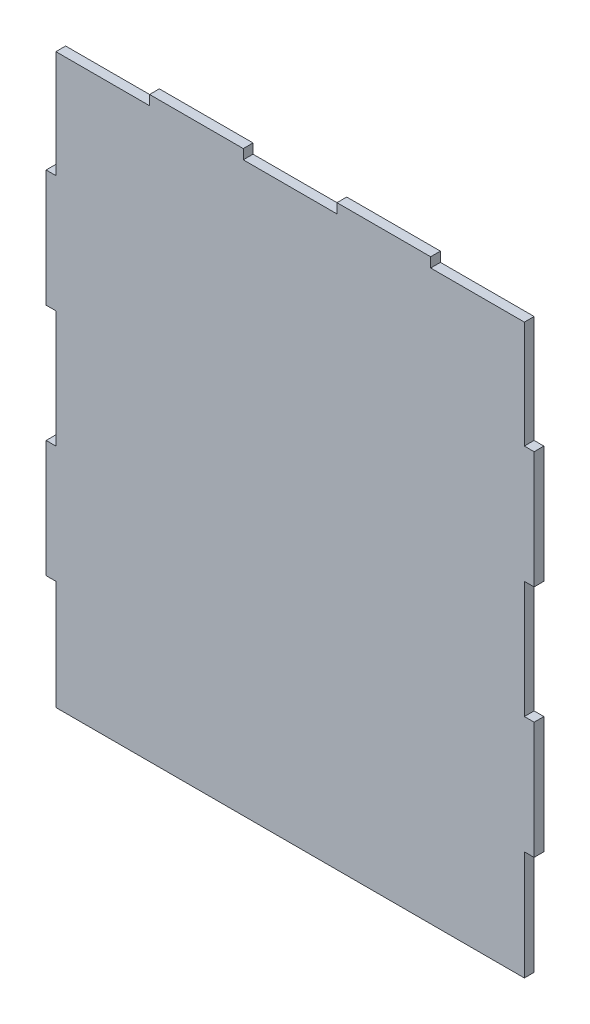
ISO-10303-21;
HEADER;
FILE_DESCRIPTION(('STEP AP214'),'2;1');
FILE_NAME('part.step','',(''),(''),'','','');
FILE_SCHEMA(('AUTOMOTIVE_DESIGN { 1 0 10303 214 1 1 1 1 }'));
ENDSEC;
DATA;
#1=APPLICATION_CONTEXT('core data for automotive mechanical design processes');
#2=APPLICATION_PROTOCOL_DEFINITION('international standard','automotive_design',2000,#1);
#3=PRODUCT_CONTEXT('',#1,'mechanical');
#4=PRODUCT('Part','Part','',(#3));
#5=PRODUCT_RELATED_PRODUCT_CATEGORY('part','',(#4));
#6=PRODUCT_DEFINITION_FORMATION('','',#4);
#7=PRODUCT_DEFINITION_CONTEXT('part definition',#1,'design');
#8=PRODUCT_DEFINITION('design','',#6,#7);
#9=PRODUCT_DEFINITION_SHAPE('','',#8);
#10=(LENGTH_UNIT() NAMED_UNIT(*) SI_UNIT(.MILLI.,.METRE.));
#11=(NAMED_UNIT(*) PLANE_ANGLE_UNIT() SI_UNIT($,.RADIAN.));
#12=(NAMED_UNIT(*) SI_UNIT($,.STERADIAN.) SOLID_ANGLE_UNIT());
#13=UNCERTAINTY_MEASURE_WITH_UNIT(LENGTH_MEASURE(1.E-05),#10,'distance_accuracy_value','');
#14=(GEOMETRIC_REPRESENTATION_CONTEXT(3) GLOBAL_UNCERTAINTY_ASSIGNED_CONTEXT((#13)) GLOBAL_UNIT_ASSIGNED_CONTEXT((#10,
#11,#12)) REPRESENTATION_CONTEXT('',''));
#15=CARTESIAN_POINT('',(0.,0.,0.));
#16=DIRECTION('',(0.,0.,1.));
#17=DIRECTION('',(1.,0.,0.));
#18=AXIS2_PLACEMENT_3D('',#15,#16,#17);
#19=CARTESIAN_POINT('',(245.,236.,5.));
#20=DIRECTION('',(0.,-1.,0.));
#21=DIRECTION('',(1.,0.,0.));
#22=AXIS2_PLACEMENT_3D('',#19,#20,#21);
#23=PLANE('',#22);
#24=DIRECTION('',(-1.,0.,0.));
#25=VECTOR('',#24,1.);
#26=CARTESIAN_POINT('',(245.,236.,0.));
#27=LINE('',#26,#25);
#28=CARTESIAN_POINT('',(250.,236.,0.));
#29=VERTEX_POINT('',#28);
#30=CARTESIAN_POINT('',(245.,236.,0.));
#31=VERTEX_POINT('',#30);
#32=EDGE_CURVE('E252',#29,#31,#27,.T.);
#33=ORIENTED_EDGE('',*,*,#32,.T.);
#34=DIRECTION('',(0.,0.,-1.));
#35=VECTOR('',#34,1.);
#36=CARTESIAN_POINT('',(245.,236.,5.));
#37=LINE('',#36,#35);
#38=CARTESIAN_POINT('',(245.,236.,5.));
#39=VERTEX_POINT('',#38);
#40=EDGE_CURVE('E11',#39,#31,#37,.T.);
#41=ORIENTED_EDGE('',*,*,#40,.F.);
#42=DIRECTION('',(-1.,0.,0.));
#43=VECTOR('',#42,1.);
#44=CARTESIAN_POINT('',(245.,236.,5.));
#45=LINE('',#44,#43);
#46=CARTESIAN_POINT('',(250.,236.,5.));
#47=VERTEX_POINT('',#46);
#48=EDGE_CURVE('E306',#47,#39,#45,.T.);
#49=ORIENTED_EDGE('',*,*,#48,.F.);
#50=DIRECTION('',(0.,0.,-1.));
#51=VECTOR('',#50,1.);
#52=CARTESIAN_POINT('',(250.,236.,5.));
#53=LINE('',#52,#51);
#54=EDGE_CURVE('E248',#47,#29,#53,.T.);
#55=ORIENTED_EDGE('',*,*,#54,.T.);
#56=EDGE_LOOP('',(#33,#41,#49,#55));
#57=FACE_BOUND('',#56,.T.);
#58=ADVANCED_FACE('F36',(#57),#23,.F.);
#59=CARTESIAN_POINT('',(245.,291.,5.));
#60=DIRECTION('',(-1.,0.,0.));
#61=DIRECTION('',(0.,0.,1.));
#62=AXIS2_PLACEMENT_3D('',#59,#60,#61);
#63=PLANE('',#62);
#64=DIRECTION('',(0.,1.,0.));
#65=VECTOR('',#64,1.);
#66=CARTESIAN_POINT('',(245.,291.,0.));
#67=LINE('',#66,#65);
#68=CARTESIAN_POINT('',(245.,291.,0.));
#69=VERTEX_POINT('',#68);
#70=EDGE_CURVE('E255',#31,#69,#67,.T.);
#71=ORIENTED_EDGE('',*,*,#70,.T.);
#72=DIRECTION('',(0.,0.,-1.));
#73=VECTOR('',#72,1.);
#74=CARTESIAN_POINT('',(245.,291.,5.));
#75=LINE('',#74,#73);
#76=CARTESIAN_POINT('',(245.,291.,5.));
#77=VERTEX_POINT('',#76);
#78=EDGE_CURVE('E44',#77,#69,#75,.T.);
#79=ORIENTED_EDGE('',*,*,#78,.F.);
#80=DIRECTION('',(0.,1.,0.));
#81=VECTOR('',#80,1.);
#82=CARTESIAN_POINT('',(245.,291.,5.));
#83=LINE('',#82,#81);
#84=EDGE_CURVE('E155',#39,#77,#83,.T.);
#85=ORIENTED_EDGE('',*,*,#84,.F.);
#86=ORIENTED_EDGE('',*,*,#40,.T.);
#87=EDGE_LOOP('',(#71,#79,#85,#86));
#88=FACE_BOUND('',#87,.T.);
#89=ADVANCED_FACE('F464',(#88),#63,.F.);
#90=CARTESIAN_POINT('',(197.,291.,5.));
#91=DIRECTION('',(0.,-1.,0.));
#92=DIRECTION('',(0.,0.,-1.));
#93=AXIS2_PLACEMENT_3D('',#90,#91,#92);
#94=PLANE('',#93);
#95=DIRECTION('',(-1.,0.,0.));
#96=VECTOR('',#95,1.);
#97=CARTESIAN_POINT('',(197.,291.,0.));
#98=LINE('',#97,#96);
#99=CARTESIAN_POINT('',(197.,291.,0.));
#100=VERTEX_POINT('',#99);
#101=EDGE_CURVE('E257',#69,#100,#98,.T.);
#102=ORIENTED_EDGE('',*,*,#101,.T.);
#103=DIRECTION('',(0.,0.,-1.));
#104=VECTOR('',#103,1.);
#105=CARTESIAN_POINT('',(197.,291.,5.));
#106=LINE('',#105,#104);
#107=CARTESIAN_POINT('',(197.,291.,5.));
#108=VERTEX_POINT('',#107);
#109=EDGE_CURVE('E373',#108,#100,#106,.T.);
#110=ORIENTED_EDGE('',*,*,#109,.F.);
#111=DIRECTION('',(-1.,0.,0.));
#112=VECTOR('',#111,1.);
#113=CARTESIAN_POINT('',(197.,291.,5.));
#114=LINE('',#113,#112);
#115=EDGE_CURVE('E381',#77,#108,#114,.T.);
#116=ORIENTED_EDGE('',*,*,#115,.F.);
#117=ORIENTED_EDGE('',*,*,#78,.T.);
#118=EDGE_LOOP('',(#102,#110,#116,#117));
#119=FACE_BOUND('',#118,.T.);
#120=ADVANCED_FACE('F379',(#119),#94,.F.);
#121=CARTESIAN_POINT('',(197.,296.,5.));
#122=DIRECTION('',(-1.,0.,0.));
#123=DIRECTION('',(0.,-1.,0.));
#124=AXIS2_PLACEMENT_3D('',#121,#122,#123);
#125=PLANE('',#124);
#126=DIRECTION('',(0.,1.,0.));
#127=VECTOR('',#126,1.);
#128=CARTESIAN_POINT('',(197.,296.,0.));
#129=LINE('',#128,#127);
#130=CARTESIAN_POINT('',(197.,296.,0.));
#131=VERTEX_POINT('',#130);
#132=EDGE_CURVE('E259',#100,#131,#129,.T.);
#133=ORIENTED_EDGE('',*,*,#132,.T.);
#134=DIRECTION('',(0.,0.,-1.));
#135=VECTOR('',#134,1.);
#136=CARTESIAN_POINT('',(197.,296.,5.));
#137=LINE('',#136,#135);
#138=CARTESIAN_POINT('',(197.,296.,5.));
#139=VERTEX_POINT('',#138);
#140=EDGE_CURVE('E370',#139,#131,#137,.T.);
#141=ORIENTED_EDGE('',*,*,#140,.F.);
#142=DIRECTION('',(0.,1.,0.));
#143=VECTOR('',#142,1.);
#144=CARTESIAN_POINT('',(197.,296.,5.));
#145=LINE('',#144,#143);
#146=EDGE_CURVE('E399',#108,#139,#145,.T.);
#147=ORIENTED_EDGE('',*,*,#146,.F.);
#148=ORIENTED_EDGE('',*,*,#109,.T.);
#149=EDGE_LOOP('',(#133,#141,#147,#148));
#150=FACE_BOUND('',#149,.T.);
#151=ADVANCED_FACE('F390',(#150),#125,.F.);
#152=CARTESIAN_POINT('',(149.,296.,5.));
#153=DIRECTION('',(0.,-1.,0.));
#154=DIRECTION('',(0.,0.,-1.));
#155=AXIS2_PLACEMENT_3D('',#152,#153,#154);
#156=PLANE('',#155);
#157=DIRECTION('',(-1.,0.,0.));
#158=VECTOR('',#157,1.);
#159=CARTESIAN_POINT('',(149.,296.,0.));
#160=LINE('',#159,#158);
#161=CARTESIAN_POINT('',(149.,296.,0.));
#162=VERTEX_POINT('',#161);
#163=EDGE_CURVE('E261',#131,#162,#160,.T.);
#164=ORIENTED_EDGE('',*,*,#163,.T.);
#165=DIRECTION('',(0.,0.,-1.));
#166=VECTOR('',#165,1.);
#167=CARTESIAN_POINT('',(149.,296.,5.));
#168=LINE('',#167,#166);
#169=CARTESIAN_POINT('',(149.,296.,5.));
#170=VERTEX_POINT('',#169);
#171=EDGE_CURVE('E367',#170,#162,#168,.T.);
#172=ORIENTED_EDGE('',*,*,#171,.F.);
#173=DIRECTION('',(-1.,0.,0.));
#174=VECTOR('',#173,1.);
#175=CARTESIAN_POINT('',(149.,296.,5.));
#176=LINE('',#175,#174);
#177=EDGE_CURVE('E396',#139,#170,#176,.T.);
#178=ORIENTED_EDGE('',*,*,#177,.F.);
#179=ORIENTED_EDGE('',*,*,#140,.T.);
#180=EDGE_LOOP('',(#164,#172,#178,#179));
#181=FACE_BOUND('',#180,.T.);
#182=ADVANCED_FACE('F394',(#181),#156,.F.);
#183=CARTESIAN_POINT('',(149.,291.,5.));
#184=DIRECTION('',(1.,0.,0.));
#185=DIRECTION('',(0.,0.,-1.));
#186=AXIS2_PLACEMENT_3D('',#183,#184,#185);
#187=PLANE('',#186);
#188=DIRECTION('',(0.,-1.,0.));
#189=VECTOR('',#188,1.);
#190=CARTESIAN_POINT('',(149.,291.,0.));
#191=LINE('',#190,#189);
#192=CARTESIAN_POINT('',(149.,291.,0.));
#193=VERTEX_POINT('',#192);
#194=EDGE_CURVE('E263',#162,#193,#191,.T.);
#195=ORIENTED_EDGE('',*,*,#194,.T.);
#196=DIRECTION('',(0.,0.,-1.));
#197=VECTOR('',#196,1.);
#198=CARTESIAN_POINT('',(149.,291.,5.));
#199=LINE('',#198,#197);
#200=CARTESIAN_POINT('',(149.,291.,5.));
#201=VERTEX_POINT('',#200);
#202=EDGE_CURVE('E364',#201,#193,#199,.T.);
#203=ORIENTED_EDGE('',*,*,#202,.F.);
#204=DIRECTION('',(0.,-1.,0.));
#205=VECTOR('',#204,1.);
#206=CARTESIAN_POINT('',(149.,291.,5.));
#207=LINE('',#206,#205);
#208=EDGE_CURVE('E398',#170,#201,#207,.T.);
#209=ORIENTED_EDGE('',*,*,#208,.F.);
#210=ORIENTED_EDGE('',*,*,#171,.T.);
#211=EDGE_LOOP('',(#195,#203,#209,#210));
#212=FACE_BOUND('',#211,.T.);
#213=ADVANCED_FACE('F477',(#212),#187,.F.);
#214=CARTESIAN_POINT('',(101.,291.,5.));
#215=DIRECTION('',(0.,-1.,0.));
#216=DIRECTION('',(0.,0.,-1.));
#217=AXIS2_PLACEMENT_3D('',#214,#215,#216);
#218=PLANE('',#217);
#219=DIRECTION('',(-1.,0.,0.));
#220=VECTOR('',#219,1.);
#221=CARTESIAN_POINT('',(101.,291.,0.));
#222=LINE('',#221,#220);
#223=CARTESIAN_POINT('',(101.,291.,0.));
#224=VERTEX_POINT('',#223);
#225=EDGE_CURVE('E265',#193,#224,#222,.T.);
#226=ORIENTED_EDGE('',*,*,#225,.T.);
#227=DIRECTION('',(0.,0.,-1.));
#228=VECTOR('',#227,1.);
#229=CARTESIAN_POINT('',(101.,291.,5.));
#230=LINE('',#229,#228);
#231=CARTESIAN_POINT('',(101.,291.,5.));
#232=VERTEX_POINT('',#231);
#233=EDGE_CURVE('E361',#232,#224,#230,.T.);
#234=ORIENTED_EDGE('',*,*,#233,.F.);
#235=DIRECTION('',(-1.,0.,0.));
#236=VECTOR('',#235,1.);
#237=CARTESIAN_POINT('',(101.,291.,5.));
#238=LINE('',#237,#236);
#239=EDGE_CURVE('E401',#201,#232,#238,.T.);
#240=ORIENTED_EDGE('',*,*,#239,.F.);
#241=ORIENTED_EDGE('',*,*,#202,.T.);
#242=EDGE_LOOP('',(#226,#234,#240,#241));
#243=FACE_BOUND('',#242,.T.);
#244=ADVANCED_FACE('F480',(#243),#218,.F.);
#245=CARTESIAN_POINT('',(101.,296.,5.));
#246=DIRECTION('',(-1.,0.,0.));
#247=DIRECTION('',(0.,-1.,0.));
#248=AXIS2_PLACEMENT_3D('',#245,#246,#247);
#249=PLANE('',#248);
#250=DIRECTION('',(0.,1.,0.));
#251=VECTOR('',#250,1.);
#252=CARTESIAN_POINT('',(101.,296.,0.));
#253=LINE('',#252,#251);
#254=CARTESIAN_POINT('',(101.,296.,0.));
#255=VERTEX_POINT('',#254);
#256=EDGE_CURVE('E267',#224,#255,#253,.T.);
#257=ORIENTED_EDGE('',*,*,#256,.T.);
#258=DIRECTION('',(0.,0.,-1.));
#259=VECTOR('',#258,1.);
#260=CARTESIAN_POINT('',(101.,296.,5.));
#261=LINE('',#260,#259);
#262=CARTESIAN_POINT('',(101.,296.,5.));
#263=VERTEX_POINT('',#262);
#264=EDGE_CURVE('E358',#263,#255,#261,.T.);
#265=ORIENTED_EDGE('',*,*,#264,.F.);
#266=DIRECTION('',(0.,1.,0.));
#267=VECTOR('',#266,1.);
#268=CARTESIAN_POINT('',(101.,296.,5.));
#269=LINE('',#268,#267);
#270=EDGE_CURVE('E407',#232,#263,#269,.T.);
#271=ORIENTED_EDGE('',*,*,#270,.F.);
#272=ORIENTED_EDGE('',*,*,#233,.T.);
#273=EDGE_LOOP('',(#257,#265,#271,#272));
#274=FACE_BOUND('',#273,.T.);
#275=ADVANCED_FACE('F484',(#274),#249,.F.);
#276=CARTESIAN_POINT('',(53.,296.,5.));
#277=DIRECTION('',(0.,-1.,0.));
#278=DIRECTION('',(0.,0.,-1.));
#279=AXIS2_PLACEMENT_3D('',#276,#277,#278);
#280=PLANE('',#279);
#281=DIRECTION('',(-1.,0.,0.));
#282=VECTOR('',#281,1.);
#283=CARTESIAN_POINT('',(53.,296.,0.));
#284=LINE('',#283,#282);
#285=CARTESIAN_POINT('',(53.,296.,0.));
#286=VERTEX_POINT('',#285);
#287=EDGE_CURVE('E269',#255,#286,#284,.T.);
#288=ORIENTED_EDGE('',*,*,#287,.T.);
#289=DIRECTION('',(0.,0.,-1.));
#290=VECTOR('',#289,1.);
#291=CARTESIAN_POINT('',(53.,296.,5.));
#292=LINE('',#291,#290);
#293=CARTESIAN_POINT('',(53.,296.,5.));
#294=VERTEX_POINT('',#293);
#295=EDGE_CURVE('E355',#294,#286,#292,.T.);
#296=ORIENTED_EDGE('',*,*,#295,.F.);
#297=DIRECTION('',(-1.,0.,0.));
#298=VECTOR('',#297,1.);
#299=CARTESIAN_POINT('',(53.,296.,5.));
#300=LINE('',#299,#298);
#301=EDGE_CURVE('E409',#263,#294,#300,.T.);
#302=ORIENTED_EDGE('',*,*,#301,.F.);
#303=ORIENTED_EDGE('',*,*,#264,.T.);
#304=EDGE_LOOP('',(#288,#296,#302,#303));
#305=FACE_BOUND('',#304,.T.);
#306=ADVANCED_FACE('F488',(#305),#280,.F.);
#307=CARTESIAN_POINT('',(53.,291.,5.));
#308=DIRECTION('',(1.,0.,0.));
#309=DIRECTION('',(0.,1.,0.));
#310=AXIS2_PLACEMENT_3D('',#307,#308,#309);
#311=PLANE('',#310);
#312=DIRECTION('',(0.,-1.,0.));
#313=VECTOR('',#312,1.);
#314=CARTESIAN_POINT('',(53.,291.,0.));
#315=LINE('',#314,#313);
#316=CARTESIAN_POINT('',(53.,291.,0.));
#317=VERTEX_POINT('',#316);
#318=EDGE_CURVE('E271',#286,#317,#315,.T.);
#319=ORIENTED_EDGE('',*,*,#318,.T.);
#320=DIRECTION('',(0.,0.,-1.));
#321=VECTOR('',#320,1.);
#322=CARTESIAN_POINT('',(53.,291.,5.));
#323=LINE('',#322,#321);
#324=CARTESIAN_POINT('',(53.,291.,5.));
#325=VERTEX_POINT('',#324);
#326=EDGE_CURVE('E352',#325,#317,#323,.T.);
#327=ORIENTED_EDGE('',*,*,#326,.F.);
#328=DIRECTION('',(0.,-1.,0.));
#329=VECTOR('',#328,1.);
#330=CARTESIAN_POINT('',(53.,291.,5.));
#331=LINE('',#330,#329);
#332=EDGE_CURVE('E411',#294,#325,#331,.T.);
#333=ORIENTED_EDGE('',*,*,#332,.F.);
#334=ORIENTED_EDGE('',*,*,#295,.T.);
#335=EDGE_LOOP('',(#319,#327,#333,#334));
#336=FACE_BOUND('',#335,.T.);
#337=ADVANCED_FACE('F492',(#336),#311,.F.);
#338=CARTESIAN_POINT('',(5.,291.,5.));
#339=DIRECTION('',(0.,-1.,0.));
#340=DIRECTION('',(0.,0.,-1.));
#341=AXIS2_PLACEMENT_3D('',#338,#339,#340);
#342=PLANE('',#341);
#343=DIRECTION('',(-1.,0.,0.));
#344=VECTOR('',#343,1.);
#345=CARTESIAN_POINT('',(5.,291.,0.));
#346=LINE('',#345,#344);
#347=CARTESIAN_POINT('',(5.,291.,0.));
#348=VERTEX_POINT('',#347);
#349=EDGE_CURVE('E273',#317,#348,#346,.T.);
#350=ORIENTED_EDGE('',*,*,#349,.T.);
#351=DIRECTION('',(0.,0.,-1.));
#352=VECTOR('',#351,1.);
#353=CARTESIAN_POINT('',(5.,291.,5.));
#354=LINE('',#353,#352);
#355=CARTESIAN_POINT('',(5.,291.,5.));
#356=VERTEX_POINT('',#355);
#357=EDGE_CURVE('E349',#356,#348,#354,.T.);
#358=ORIENTED_EDGE('',*,*,#357,.F.);
#359=DIRECTION('',(-1.,0.,0.));
#360=VECTOR('',#359,1.);
#361=CARTESIAN_POINT('',(5.,291.,5.));
#362=LINE('',#361,#360);
#363=EDGE_CURVE('E413',#325,#356,#362,.T.);
#364=ORIENTED_EDGE('',*,*,#363,.F.);
#365=ORIENTED_EDGE('',*,*,#326,.T.);
#366=EDGE_LOOP('',(#350,#358,#364,#365));
#367=FACE_BOUND('',#366,.T.);
#368=ADVANCED_FACE('F496',(#367),#342,.F.);
#369=CARTESIAN_POINT('',(5.,291.,5.));
#370=DIRECTION('',(1.,0.,0.));
#371=DIRECTION('',(0.,0.,-1.));
#372=AXIS2_PLACEMENT_3D('',#369,#370,#371);
#373=PLANE('',#372);
#374=DIRECTION('',(0.,-1.,0.));
#375=VECTOR('',#374,1.);
#376=CARTESIAN_POINT('',(5.,291.,0.));
#377=LINE('',#376,#375);
#378=CARTESIAN_POINT('',(5.,236.,0.));
#379=VERTEX_POINT('',#378);
#380=EDGE_CURVE('E275',#348,#379,#377,.T.);
#381=ORIENTED_EDGE('',*,*,#380,.T.);
#382=DIRECTION('',(0.,0.,-1.));
#383=VECTOR('',#382,1.);
#384=CARTESIAN_POINT('',(5.,236.,5.));
#385=LINE('',#384,#383);
#386=CARTESIAN_POINT('',(5.,236.,5.));
#387=VERTEX_POINT('',#386);
#388=EDGE_CURVE('E346',#387,#379,#385,.T.);
#389=ORIENTED_EDGE('',*,*,#388,.F.);
#390=DIRECTION('',(0.,-1.,0.));
#391=VECTOR('',#390,1.);
#392=CARTESIAN_POINT('',(5.,291.,5.));
#393=LINE('',#392,#391);
#394=EDGE_CURVE('E415',#356,#387,#393,.T.);
#395=ORIENTED_EDGE('',*,*,#394,.F.);
#396=ORIENTED_EDGE('',*,*,#357,.T.);
#397=EDGE_LOOP('',(#381,#389,#395,#396));
#398=FACE_BOUND('',#397,.T.);
#399=ADVANCED_FACE('F500',(#398),#373,.F.);
#400=CARTESIAN_POINT('',(5.,236.,5.));
#401=DIRECTION('',(0.,-1.,0.));
#402=DIRECTION('',(0.,0.,-1.));
#403=AXIS2_PLACEMENT_3D('',#400,#401,#402);
#404=PLANE('',#403);
#405=DIRECTION('',(-1.,0.,0.));
#406=VECTOR('',#405,1.);
#407=CARTESIAN_POINT('',(5.,236.,0.));
#408=LINE('',#407,#406);
#409=CARTESIAN_POINT('',(0.,236.,0.));
#410=VERTEX_POINT('',#409);
#411=EDGE_CURVE('E277',#379,#410,#408,.T.);
#412=ORIENTED_EDGE('',*,*,#411,.T.);
#413=DIRECTION('',(0.,0.,-1.));
#414=VECTOR('',#413,1.);
#415=CARTESIAN_POINT('',(0.,236.,5.));
#416=LINE('',#415,#414);
#417=CARTESIAN_POINT('',(0.,236.,5.));
#418=VERTEX_POINT('',#417);
#419=EDGE_CURVE('E343',#418,#410,#416,.T.);
#420=ORIENTED_EDGE('',*,*,#419,.F.);
#421=DIRECTION('',(-1.,0.,0.));
#422=VECTOR('',#421,1.);
#423=CARTESIAN_POINT('',(5.,236.,5.));
#424=LINE('',#423,#422);
#425=EDGE_CURVE('E417',#387,#418,#424,.T.);
#426=ORIENTED_EDGE('',*,*,#425,.F.);
#427=ORIENTED_EDGE('',*,*,#388,.T.);
#428=EDGE_LOOP('',(#412,#420,#426,#427));
#429=FACE_BOUND('',#428,.T.);
#430=ADVANCED_FACE('F504',(#429),#404,.F.);
#431=CARTESIAN_POINT('',(0.,176.,5.));
#432=DIRECTION('',(1.,0.,0.));
#433=DIRECTION('',(0.,0.,-1.));
#434=AXIS2_PLACEMENT_3D('',#431,#432,#433);
#435=PLANE('',#434);
#436=DIRECTION('',(0.,-1.,0.));
#437=VECTOR('',#436,1.);
#438=CARTESIAN_POINT('',(0.,176.,0.));
#439=LINE('',#438,#437);
#440=CARTESIAN_POINT('',(0.,176.,0.));
#441=VERTEX_POINT('',#440);
#442=EDGE_CURVE('E279',#410,#441,#439,.T.);
#443=ORIENTED_EDGE('',*,*,#442,.T.);
#444=DIRECTION('',(0.,0.,-1.));
#445=VECTOR('',#444,1.);
#446=CARTESIAN_POINT('',(0.,176.,5.));
#447=LINE('',#446,#445);
#448=CARTESIAN_POINT('',(0.,176.,5.));
#449=VERTEX_POINT('',#448);
#450=EDGE_CURVE('E340',#449,#441,#447,.T.);
#451=ORIENTED_EDGE('',*,*,#450,.F.);
#452=DIRECTION('',(0.,-1.,0.));
#453=VECTOR('',#452,1.);
#454=CARTESIAN_POINT('',(0.,176.,5.));
#455=LINE('',#454,#453);
#456=EDGE_CURVE('E419',#418,#449,#455,.T.);
#457=ORIENTED_EDGE('',*,*,#456,.F.);
#458=ORIENTED_EDGE('',*,*,#419,.T.);
#459=EDGE_LOOP('',(#443,#451,#457,#458));
#460=FACE_BOUND('',#459,.T.);
#461=ADVANCED_FACE('F508',(#460),#435,.F.);
#462=CARTESIAN_POINT('',(0.,176.,5.));
#463=DIRECTION('',(0.,1.,0.));
#464=DIRECTION('',(0.,0.,1.));
#465=AXIS2_PLACEMENT_3D('',#462,#463,#464);
#466=PLANE('',#465);
#467=DIRECTION('',(1.,0.,0.));
#468=VECTOR('',#467,1.);
#469=CARTESIAN_POINT('',(0.,176.,0.));
#470=LINE('',#469,#468);
#471=CARTESIAN_POINT('',(5.,176.,0.));
#472=VERTEX_POINT('',#471);
#473=EDGE_CURVE('E281',#441,#472,#470,.T.);
#474=ORIENTED_EDGE('',*,*,#473,.T.);
#475=DIRECTION('',(0.,0.,-1.));
#476=VECTOR('',#475,1.);
#477=CARTESIAN_POINT('',(5.,176.,5.));
#478=LINE('',#477,#476);
#479=CARTESIAN_POINT('',(5.,176.,5.));
#480=VERTEX_POINT('',#479);
#481=EDGE_CURVE('E337',#480,#472,#478,.T.);
#482=ORIENTED_EDGE('',*,*,#481,.F.);
#483=DIRECTION('',(1.,0.,0.));
#484=VECTOR('',#483,1.);
#485=CARTESIAN_POINT('',(0.,176.,5.));
#486=LINE('',#485,#484);
#487=EDGE_CURVE('E421',#449,#480,#486,.T.);
#488=ORIENTED_EDGE('',*,*,#487,.F.);
#489=ORIENTED_EDGE('',*,*,#450,.T.);
#490=EDGE_LOOP('',(#474,#482,#488,#489));
#491=FACE_BOUND('',#490,.T.);
#492=ADVANCED_FACE('F512',(#491),#466,.F.);
#493=CARTESIAN_POINT('',(5.,176.,5.));
#494=DIRECTION('',(1.,0.,0.));
#495=DIRECTION('',(0.,0.,-1.));
#496=AXIS2_PLACEMENT_3D('',#493,#494,#495);
#497=PLANE('',#496);
#498=DIRECTION('',(0.,-1.,0.));
#499=VECTOR('',#498,1.);
#500=CARTESIAN_POINT('',(5.,176.,0.));
#501=LINE('',#500,#499);
#502=CARTESIAN_POINT('',(5.,116.,0.));
#503=VERTEX_POINT('',#502);
#504=EDGE_CURVE('E283',#472,#503,#501,.T.);
#505=ORIENTED_EDGE('',*,*,#504,.T.);
#506=DIRECTION('',(0.,0.,-1.));
#507=VECTOR('',#506,1.);
#508=CARTESIAN_POINT('',(5.,116.,5.));
#509=LINE('',#508,#507);
#510=CARTESIAN_POINT('',(5.,116.,5.));
#511=VERTEX_POINT('',#510);
#512=EDGE_CURVE('E334',#511,#503,#509,.T.);
#513=ORIENTED_EDGE('',*,*,#512,.F.);
#514=DIRECTION('',(0.,-1.,0.));
#515=VECTOR('',#514,1.);
#516=CARTESIAN_POINT('',(5.,176.,5.));
#517=LINE('',#516,#515);
#518=EDGE_CURVE('E423',#480,#511,#517,.T.);
#519=ORIENTED_EDGE('',*,*,#518,.F.);
#520=ORIENTED_EDGE('',*,*,#481,.T.);
#521=EDGE_LOOP('',(#505,#513,#519,#520));
#522=FACE_BOUND('',#521,.T.);
#523=ADVANCED_FACE('F516',(#522),#497,.F.);
#524=CARTESIAN_POINT('',(5.,116.,5.));
#525=DIRECTION('',(0.,-1.,0.));
#526=DIRECTION('',(0.,0.,-1.));
#527=AXIS2_PLACEMENT_3D('',#524,#525,#526);
#528=PLANE('',#527);
#529=DIRECTION('',(-1.,0.,0.));
#530=VECTOR('',#529,1.);
#531=CARTESIAN_POINT('',(5.,116.,0.));
#532=LINE('',#531,#530);
#533=CARTESIAN_POINT('',(0.,116.,0.));
#534=VERTEX_POINT('',#533);
#535=EDGE_CURVE('E285',#503,#534,#532,.T.);
#536=ORIENTED_EDGE('',*,*,#535,.T.);
#537=DIRECTION('',(0.,0.,-1.));
#538=VECTOR('',#537,1.);
#539=CARTESIAN_POINT('',(0.,116.,5.));
#540=LINE('',#539,#538);
#541=CARTESIAN_POINT('',(0.,116.,5.));
#542=VERTEX_POINT('',#541);
#543=EDGE_CURVE('E331',#542,#534,#540,.T.);
#544=ORIENTED_EDGE('',*,*,#543,.F.);
#545=DIRECTION('',(-1.,0.,0.));
#546=VECTOR('',#545,1.);
#547=CARTESIAN_POINT('',(5.,116.,5.));
#548=LINE('',#547,#546);
#549=EDGE_CURVE('E425',#511,#542,#548,.T.);
#550=ORIENTED_EDGE('',*,*,#549,.F.);
#551=ORIENTED_EDGE('',*,*,#512,.T.);
#552=EDGE_LOOP('',(#536,#544,#550,#551));
#553=FACE_BOUND('',#552,.T.);
#554=ADVANCED_FACE('F520',(#553),#528,.F.);
#555=CARTESIAN_POINT('',(0.,56.,5.));
#556=DIRECTION('',(1.,0.,0.));
#557=DIRECTION('',(0.,1.,0.));
#558=AXIS2_PLACEMENT_3D('',#555,#556,#557);
#559=PLANE('',#558);
#560=DIRECTION('',(0.,-1.,0.));
#561=VECTOR('',#560,1.);
#562=CARTESIAN_POINT('',(0.,56.,0.));
#563=LINE('',#562,#561);
#564=CARTESIAN_POINT('',(0.,56.,0.));
#565=VERTEX_POINT('',#564);
#566=EDGE_CURVE('E287',#534,#565,#563,.T.);
#567=ORIENTED_EDGE('',*,*,#566,.T.);
#568=DIRECTION('',(0.,0.,-1.));
#569=VECTOR('',#568,1.);
#570=CARTESIAN_POINT('',(0.,56.,5.));
#571=LINE('',#570,#569);
#572=CARTESIAN_POINT('',(0.,56.,5.));
#573=VERTEX_POINT('',#572);
#574=EDGE_CURVE('E328',#573,#565,#571,.T.);
#575=ORIENTED_EDGE('',*,*,#574,.F.);
#576=DIRECTION('',(0.,-1.,0.));
#577=VECTOR('',#576,1.);
#578=CARTESIAN_POINT('',(0.,56.,5.));
#579=LINE('',#578,#577);
#580=EDGE_CURVE('E427',#542,#573,#579,.T.);
#581=ORIENTED_EDGE('',*,*,#580,.F.);
#582=ORIENTED_EDGE('',*,*,#543,.T.);
#583=EDGE_LOOP('',(#567,#575,#581,#582));
#584=FACE_BOUND('',#583,.T.);
#585=ADVANCED_FACE('F524',(#584),#559,.F.);
#586=CARTESIAN_POINT('',(0.,56.,5.));
#587=DIRECTION('',(0.,1.,0.));
#588=DIRECTION('',(0.,0.,1.));
#589=AXIS2_PLACEMENT_3D('',#586,#587,#588);
#590=PLANE('',#589);
#591=DIRECTION('',(1.,0.,0.));
#592=VECTOR('',#591,1.);
#593=CARTESIAN_POINT('',(0.,56.,0.));
#594=LINE('',#593,#592);
#595=CARTESIAN_POINT('',(5.,56.,0.));
#596=VERTEX_POINT('',#595);
#597=EDGE_CURVE('E289',#565,#596,#594,.T.);
#598=ORIENTED_EDGE('',*,*,#597,.T.);
#599=DIRECTION('',(0.,0.,-1.));
#600=VECTOR('',#599,1.);
#601=CARTESIAN_POINT('',(5.,56.,5.));
#602=LINE('',#601,#600);
#603=CARTESIAN_POINT('',(5.,56.,5.));
#604=VERTEX_POINT('',#603);
#605=EDGE_CURVE('E325',#604,#596,#602,.T.);
#606=ORIENTED_EDGE('',*,*,#605,.F.);
#607=DIRECTION('',(1.,0.,0.));
#608=VECTOR('',#607,1.);
#609=CARTESIAN_POINT('',(0.,56.,5.));
#610=LINE('',#609,#608);
#611=EDGE_CURVE('E429',#573,#604,#610,.T.);
#612=ORIENTED_EDGE('',*,*,#611,.F.);
#613=ORIENTED_EDGE('',*,*,#574,.T.);
#614=EDGE_LOOP('',(#598,#606,#612,#613));
#615=FACE_BOUND('',#614,.T.);
#616=ADVANCED_FACE('F528',(#615),#590,.F.);
#617=CARTESIAN_POINT('',(5.,56.,5.));
#618=DIRECTION('',(1.,0.,0.));
#619=DIRECTION('',(0.,1.,0.));
#620=AXIS2_PLACEMENT_3D('',#617,#618,#619);
#621=PLANE('',#620);
#622=DIRECTION('',(0.,-1.,0.));
#623=VECTOR('',#622,1.);
#624=CARTESIAN_POINT('',(5.,56.,0.));
#625=LINE('',#624,#623);
#626=CARTESIAN_POINT('',(5.00000000000004,0.,0.));
#627=VERTEX_POINT('',#626);
#628=EDGE_CURVE('E291',#596,#627,#625,.T.);
#629=ORIENTED_EDGE('',*,*,#628,.T.);
#630=DIRECTION('',(0.,0.,-1.));
#631=VECTOR('',#630,1.);
#632=CARTESIAN_POINT('',(5.00000000000004,0.,5.));
#633=LINE('',#632,#631);
#634=CARTESIAN_POINT('',(5.00000000000004,0.,5.));
#635=VERTEX_POINT('',#634);
#636=EDGE_CURVE('E322',#635,#627,#633,.T.);
#637=ORIENTED_EDGE('',*,*,#636,.F.);
#638=DIRECTION('',(0.,-1.,0.));
#639=VECTOR('',#638,1.);
#640=CARTESIAN_POINT('',(5.,56.,5.));
#641=LINE('',#640,#639);
#642=EDGE_CURVE('E431',#604,#635,#641,.T.);
#643=ORIENTED_EDGE('',*,*,#642,.F.);
#644=ORIENTED_EDGE('',*,*,#605,.T.);
#645=EDGE_LOOP('',(#629,#637,#643,#644));
#646=FACE_BOUND('',#645,.T.);
#647=ADVANCED_FACE('F532',(#646),#621,.F.);
#648=CARTESIAN_POINT('',(5.00000000000004,0.,5.));
#649=DIRECTION('',(0.,1.,0.));
#650=DIRECTION('',(0.,0.,1.));
#651=AXIS2_PLACEMENT_3D('',#648,#649,#650);
#652=PLANE('',#651);
#653=DIRECTION('',(1.,0.,0.));
#654=VECTOR('',#653,1.);
#655=CARTESIAN_POINT('',(5.00000000000004,0.,0.));
#656=LINE('',#655,#654);
#657=CARTESIAN_POINT('',(245.,0.,0.));
#658=VERTEX_POINT('',#657);
#659=EDGE_CURVE('E293',#627,#658,#656,.T.);
#660=ORIENTED_EDGE('',*,*,#659,.T.);
#661=DIRECTION('',(0.,0.,-1.));
#662=VECTOR('',#661,1.);
#663=CARTESIAN_POINT('',(245.,0.,5.));
#664=LINE('',#663,#662);
#665=CARTESIAN_POINT('',(245.,0.,5.));
#666=VERTEX_POINT('',#665);
#667=EDGE_CURVE('E319',#666,#658,#664,.T.);
#668=ORIENTED_EDGE('',*,*,#667,.F.);
#669=DIRECTION('',(1.,0.,0.));
#670=VECTOR('',#669,1.);
#671=CARTESIAN_POINT('',(5.00000000000004,0.,5.));
#672=LINE('',#671,#670);
#673=EDGE_CURVE('E433',#635,#666,#672,.T.);
#674=ORIENTED_EDGE('',*,*,#673,.F.);
#675=ORIENTED_EDGE('',*,*,#636,.T.);
#676=EDGE_LOOP('',(#660,#668,#674,#675));
#677=FACE_BOUND('',#676,.T.);
#678=ADVANCED_FACE('F536',(#677),#652,.F.);
#679=CARTESIAN_POINT('',(245.,56.,5.));
#680=DIRECTION('',(-1.,0.,0.));
#681=DIRECTION('',(0.,0.,1.));
#682=AXIS2_PLACEMENT_3D('',#679,#680,#681);
#683=PLANE('',#682);
#684=DIRECTION('',(0.,1.,0.));
#685=VECTOR('',#684,1.);
#686=CARTESIAN_POINT('',(245.,56.,0.));
#687=LINE('',#686,#685);
#688=CARTESIAN_POINT('',(245.,56.,0.));
#689=VERTEX_POINT('',#688);
#690=EDGE_CURVE('E295',#658,#689,#687,.T.);
#691=ORIENTED_EDGE('',*,*,#690,.T.);
#692=DIRECTION('',(0.,0.,-1.));
#693=VECTOR('',#692,1.);
#694=CARTESIAN_POINT('',(245.,56.,5.));
#695=LINE('',#694,#693);
#696=CARTESIAN_POINT('',(245.,56.,5.));
#697=VERTEX_POINT('',#696);
#698=EDGE_CURVE('E316',#697,#689,#695,.T.);
#699=ORIENTED_EDGE('',*,*,#698,.F.);
#700=DIRECTION('',(0.,1.,0.));
#701=VECTOR('',#700,1.);
#702=CARTESIAN_POINT('',(245.,56.,5.));
#703=LINE('',#702,#701);
#704=EDGE_CURVE('E435',#666,#697,#703,.T.);
#705=ORIENTED_EDGE('',*,*,#704,.F.);
#706=ORIENTED_EDGE('',*,*,#667,.T.);
#707=EDGE_LOOP('',(#691,#699,#705,#706));
#708=FACE_BOUND('',#707,.T.);
#709=ADVANCED_FACE('F540',(#708),#683,.F.);
#710=CARTESIAN_POINT('',(250.,56.,5.));
#711=DIRECTION('',(0.,1.,0.));
#712=DIRECTION('',(0.,0.,1.));
#713=AXIS2_PLACEMENT_3D('',#710,#711,#712);
#714=PLANE('',#713);
#715=DIRECTION('',(1.,0.,0.));
#716=VECTOR('',#715,1.);
#717=CARTESIAN_POINT('',(250.,56.,0.));
#718=LINE('',#717,#716);
#719=CARTESIAN_POINT('',(250.,56.,0.));
#720=VERTEX_POINT('',#719);
#721=EDGE_CURVE('E297',#689,#720,#718,.T.);
#722=ORIENTED_EDGE('',*,*,#721,.T.);
#723=DIRECTION('',(0.,0.,-1.));
#724=VECTOR('',#723,1.);
#725=CARTESIAN_POINT('',(250.,56.,5.));
#726=LINE('',#725,#724);
#727=CARTESIAN_POINT('',(250.,56.,5.));
#728=VERTEX_POINT('',#727);
#729=EDGE_CURVE('E313',#728,#720,#726,.T.);
#730=ORIENTED_EDGE('',*,*,#729,.F.);
#731=DIRECTION('',(1.,0.,0.));
#732=VECTOR('',#731,1.);
#733=CARTESIAN_POINT('',(250.,56.,5.));
#734=LINE('',#733,#732);
#735=EDGE_CURVE('E437',#697,#728,#734,.T.);
#736=ORIENTED_EDGE('',*,*,#735,.F.);
#737=ORIENTED_EDGE('',*,*,#698,.T.);
#738=EDGE_LOOP('',(#722,#730,#736,#737));
#739=FACE_BOUND('',#738,.T.);
#740=ADVANCED_FACE('F544',(#739),#714,.F.);
#741=CARTESIAN_POINT('',(250.,56.,5.));
#742=DIRECTION('',(-1.,0.,0.));
#743=DIRECTION('',(0.,0.,1.));
#744=AXIS2_PLACEMENT_3D('',#741,#742,#743);
#745=PLANE('',#744);
#746=DIRECTION('',(0.,1.,0.));
#747=VECTOR('',#746,1.);
#748=CARTESIAN_POINT('',(250.,56.,0.));
#749=LINE('',#748,#747);
#750=CARTESIAN_POINT('',(250.,116.,0.));
#751=VERTEX_POINT('',#750);
#752=EDGE_CURVE('E299',#720,#751,#749,.T.);
#753=ORIENTED_EDGE('',*,*,#752,.T.);
#754=DIRECTION('',(0.,0.,-1.));
#755=VECTOR('',#754,1.);
#756=CARTESIAN_POINT('',(250.,116.,5.));
#757=LINE('',#756,#755);
#758=CARTESIAN_POINT('',(250.,116.,5.));
#759=VERTEX_POINT('',#758);
#760=EDGE_CURVE('E310',#759,#751,#757,.T.);
#761=ORIENTED_EDGE('',*,*,#760,.F.);
#762=DIRECTION('',(0.,1.,0.));
#763=VECTOR('',#762,1.);
#764=CARTESIAN_POINT('',(250.,56.,5.));
#765=LINE('',#764,#763);
#766=EDGE_CURVE('E439',#728,#759,#765,.T.);
#767=ORIENTED_EDGE('',*,*,#766,.F.);
#768=ORIENTED_EDGE('',*,*,#729,.T.);
#769=EDGE_LOOP('',(#753,#761,#767,#768));
#770=FACE_BOUND('',#769,.T.);
#771=ADVANCED_FACE('F445',(#770),#745,.F.);
#772=CARTESIAN_POINT('',(245.,116.,5.));
#773=DIRECTION('',(0.,-1.,0.));
#774=DIRECTION('',(0.,0.,-1.));
#775=AXIS2_PLACEMENT_3D('',#772,#773,#774);
#776=PLANE('',#775);
#777=DIRECTION('',(-1.,0.,0.));
#778=VECTOR('',#777,1.);
#779=CARTESIAN_POINT('',(245.,116.,0.));
#780=LINE('',#779,#778);
#781=CARTESIAN_POINT('',(245.,116.,0.));
#782=VERTEX_POINT('',#781);
#783=EDGE_CURVE('E301',#751,#782,#780,.T.);
#784=ORIENTED_EDGE('',*,*,#783,.T.);
#785=DIRECTION('',(0.,0.,-1.));
#786=VECTOR('',#785,1.);
#787=CARTESIAN_POINT('',(245.,116.,5.));
#788=LINE('',#787,#786);
#789=CARTESIAN_POINT('',(245.,116.,5.));
#790=VERTEX_POINT('',#789);
#791=EDGE_CURVE('E243',#790,#782,#788,.T.);
#792=ORIENTED_EDGE('',*,*,#791,.F.);
#793=DIRECTION('',(-1.,0.,0.));
#794=VECTOR('',#793,1.);
#795=CARTESIAN_POINT('',(245.,116.,5.));
#796=LINE('',#795,#794);
#797=EDGE_CURVE('E234',#759,#790,#796,.T.);
#798=ORIENTED_EDGE('',*,*,#797,.F.);
#799=ORIENTED_EDGE('',*,*,#760,.T.);
#800=EDGE_LOOP('',(#784,#792,#798,#799));
#801=FACE_BOUND('',#800,.T.);
#802=ADVANCED_FACE('F449',(#801),#776,.F.);
#803=CARTESIAN_POINT('',(245.,176.,5.));
#804=DIRECTION('',(-1.,0.,0.));
#805=DIRECTION('',(0.,0.,1.));
#806=AXIS2_PLACEMENT_3D('',#803,#804,#805);
#807=PLANE('',#806);
#808=DIRECTION('',(0.,1.,0.));
#809=VECTOR('',#808,1.);
#810=CARTESIAN_POINT('',(245.,176.,0.));
#811=LINE('',#810,#809);
#812=CARTESIAN_POINT('',(245.,176.,0.));
#813=VERTEX_POINT('',#812);
#814=EDGE_CURVE('E242',#782,#813,#811,.T.);
#815=ORIENTED_EDGE('',*,*,#814,.T.);
#816=DIRECTION('',(0.,0.,-1.));
#817=VECTOR('',#816,1.);
#818=CARTESIAN_POINT('',(245.,176.,5.));
#819=LINE('',#818,#817);
#820=CARTESIAN_POINT('',(245.,176.,5.));
#821=VERTEX_POINT('',#820);
#822=EDGE_CURVE('E239',#821,#813,#819,.T.);
#823=ORIENTED_EDGE('',*,*,#822,.F.);
#824=DIRECTION('',(0.,1.,0.));
#825=VECTOR('',#824,1.);
#826=CARTESIAN_POINT('',(245.,176.,5.));
#827=LINE('',#826,#825);
#828=EDGE_CURVE('E228',#790,#821,#827,.T.);
#829=ORIENTED_EDGE('',*,*,#828,.F.);
#830=ORIENTED_EDGE('',*,*,#791,.T.);
#831=EDGE_LOOP('',(#815,#823,#829,#830));
#832=FACE_BOUND('',#831,.T.);
#833=ADVANCED_FACE('F240',(#832),#807,.F.);
#834=CARTESIAN_POINT('',(250.,176.,5.));
#835=DIRECTION('',(0.,1.,0.));
#836=DIRECTION('',(0.,0.,1.));
#837=AXIS2_PLACEMENT_3D('',#834,#835,#836);
#838=PLANE('',#837);
#839=DIRECTION('',(1.,0.,0.));
#840=VECTOR('',#839,1.);
#841=CARTESIAN_POINT('',(250.,176.,0.));
#842=LINE('',#841,#840);
#843=CARTESIAN_POINT('',(250.,176.,0.));
#844=VERTEX_POINT('',#843);
#845=EDGE_CURVE('E141',#813,#844,#842,.T.);
#846=ORIENTED_EDGE('',*,*,#845,.T.);
#847=DIRECTION('',(0.,0.,-1.));
#848=VECTOR('',#847,1.);
#849=CARTESIAN_POINT('',(250.,176.,5.));
#850=LINE('',#849,#848);
#851=CARTESIAN_POINT('',(250.,176.,5.));
#852=VERTEX_POINT('',#851);
#853=EDGE_CURVE('E244',#852,#844,#850,.T.);
#854=ORIENTED_EDGE('',*,*,#853,.F.);
#855=DIRECTION('',(1.,0.,0.));
#856=VECTOR('',#855,1.);
#857=CARTESIAN_POINT('',(250.,176.,5.));
#858=LINE('',#857,#856);
#859=EDGE_CURVE('E232',#821,#852,#858,.T.);
#860=ORIENTED_EDGE('',*,*,#859,.F.);
#861=ORIENTED_EDGE('',*,*,#822,.T.);
#862=EDGE_LOOP('',(#846,#854,#860,#861));
#863=FACE_BOUND('',#862,.T.);
#864=ADVANCED_FACE('F246',(#863),#838,.F.);
#865=CARTESIAN_POINT('',(250.,176.,5.));
#866=DIRECTION('',(-1.,0.,0.));
#867=DIRECTION('',(0.,0.,1.));
#868=AXIS2_PLACEMENT_3D('',#865,#866,#867);
#869=PLANE('',#868);
#870=DIRECTION('',(0.,1.,0.));
#871=VECTOR('',#870,1.);
#872=CARTESIAN_POINT('',(250.,176.,0.));
#873=LINE('',#872,#871);
#874=EDGE_CURVE('E147',#844,#29,#873,.T.);
#875=ORIENTED_EDGE('',*,*,#874,.T.);
#876=ORIENTED_EDGE('',*,*,#54,.F.);
#877=DIRECTION('',(0.,1.,0.));
#878=VECTOR('',#877,1.);
#879=CARTESIAN_POINT('',(250.,176.,5.));
#880=LINE('',#879,#878);
#881=EDGE_CURVE('E52',#852,#47,#880,.T.);
#882=ORIENTED_EDGE('',*,*,#881,.F.);
#883=ORIENTED_EDGE('',*,*,#853,.T.);
#884=EDGE_LOOP('',(#875,#876,#882,#883));
#885=FACE_BOUND('',#884,.T.);
#886=ADVANCED_FACE('F453',(#885),#869,.F.);
#887=CARTESIAN_POINT('',(0.,0.,5.));
#888=DIRECTION('',(0.,0.,1.));
#889=DIRECTION('',(1.,0.,0.));
#890=AXIS2_PLACEMENT_3D('',#887,#888,#889);
#891=PLANE('',#890);
#892=ORIENTED_EDGE('',*,*,#48,.T.);
#893=ORIENTED_EDGE('',*,*,#84,.T.);
#894=ORIENTED_EDGE('',*,*,#115,.T.);
#895=ORIENTED_EDGE('',*,*,#146,.T.);
#896=ORIENTED_EDGE('',*,*,#177,.T.);
#897=ORIENTED_EDGE('',*,*,#208,.T.);
#898=ORIENTED_EDGE('',*,*,#239,.T.);
#899=ORIENTED_EDGE('',*,*,#270,.T.);
#900=ORIENTED_EDGE('',*,*,#301,.T.);
#901=ORIENTED_EDGE('',*,*,#332,.T.);
#902=ORIENTED_EDGE('',*,*,#363,.T.);
#903=ORIENTED_EDGE('',*,*,#394,.T.);
#904=ORIENTED_EDGE('',*,*,#425,.T.);
#905=ORIENTED_EDGE('',*,*,#456,.T.);
#906=ORIENTED_EDGE('',*,*,#487,.T.);
#907=ORIENTED_EDGE('',*,*,#518,.T.);
#908=ORIENTED_EDGE('',*,*,#549,.T.);
#909=ORIENTED_EDGE('',*,*,#580,.T.);
#910=ORIENTED_EDGE('',*,*,#611,.T.);
#911=ORIENTED_EDGE('',*,*,#642,.T.);
#912=ORIENTED_EDGE('',*,*,#673,.T.);
#913=ORIENTED_EDGE('',*,*,#704,.T.);
#914=ORIENTED_EDGE('',*,*,#735,.T.);
#915=ORIENTED_EDGE('',*,*,#766,.T.);
#916=ORIENTED_EDGE('',*,*,#797,.T.);
#917=ORIENTED_EDGE('',*,*,#828,.T.);
#918=ORIENTED_EDGE('',*,*,#859,.T.);
#919=ORIENTED_EDGE('',*,*,#881,.T.);
#920=EDGE_LOOP('',(#892,#893,#894,#895,#896,#897,#898,#899,#900,#901,#902,#903,#904,#905,#906,
#907,#908,#909,#910,#911,#912,#913,#914,#915,#916,#917,#918,#919));
#921=FACE_BOUND('',#920,.T.);
#922=ADVANCED_FACE('F230',(#921),#891,.T.);
#923=CARTESIAN_POINT('',(0.,0.,0.));
#924=DIRECTION('',(0.,0.,1.));
#925=DIRECTION('',(1.,0.,0.));
#926=AXIS2_PLACEMENT_3D('',#923,#924,#925);
#927=PLANE('',#926);
#928=ORIENTED_EDGE('',*,*,#32,.F.);
#929=ORIENTED_EDGE('',*,*,#874,.F.);
#930=ORIENTED_EDGE('',*,*,#845,.F.);
#931=ORIENTED_EDGE('',*,*,#814,.F.);
#932=ORIENTED_EDGE('',*,*,#783,.F.);
#933=ORIENTED_EDGE('',*,*,#752,.F.);
#934=ORIENTED_EDGE('',*,*,#721,.F.);
#935=ORIENTED_EDGE('',*,*,#690,.F.);
#936=ORIENTED_EDGE('',*,*,#659,.F.);
#937=ORIENTED_EDGE('',*,*,#628,.F.);
#938=ORIENTED_EDGE('',*,*,#597,.F.);
#939=ORIENTED_EDGE('',*,*,#566,.F.);
#940=ORIENTED_EDGE('',*,*,#535,.F.);
#941=ORIENTED_EDGE('',*,*,#504,.F.);
#942=ORIENTED_EDGE('',*,*,#473,.F.);
#943=ORIENTED_EDGE('',*,*,#442,.F.);
#944=ORIENTED_EDGE('',*,*,#411,.F.);
#945=ORIENTED_EDGE('',*,*,#380,.F.);
#946=ORIENTED_EDGE('',*,*,#349,.F.);
#947=ORIENTED_EDGE('',*,*,#318,.F.);
#948=ORIENTED_EDGE('',*,*,#287,.F.);
#949=ORIENTED_EDGE('',*,*,#256,.F.);
#950=ORIENTED_EDGE('',*,*,#225,.F.);
#951=ORIENTED_EDGE('',*,*,#194,.F.);
#952=ORIENTED_EDGE('',*,*,#163,.F.);
#953=ORIENTED_EDGE('',*,*,#132,.F.);
#954=ORIENTED_EDGE('',*,*,#101,.F.);
#955=ORIENTED_EDGE('',*,*,#70,.F.);
#956=EDGE_LOOP('',(#928,#929,#930,#931,#932,#933,#934,#935,#936,#937,#938,#939,#940,#941,#942,
#943,#944,#945,#946,#947,#948,#949,#950,#951,#952,#953,#954,#955));
#957=FACE_BOUND('',#956,.T.);
#958=ADVANCED_FACE('F385',(#957),#927,.F.);
#959=CLOSED_SHELL('',(#58,#89,#120,#151,#182,#213,#244,#275,#306,#337,#368,#399,#430,#461,#492,
#523,#554,#585,#616,#647,#678,#709,#740,#771,#802,#833,#864,#886,#922,#958));
#960=MANIFOLD_SOLID_BREP('B2',#959);
#961=ADVANCED_BREP_SHAPE_REPRESENTATION('',(#18,#960),#14);
#962=SHAPE_DEFINITION_REPRESENTATION(#9,#961);
ENDSEC;
END-ISO-10303-21;
